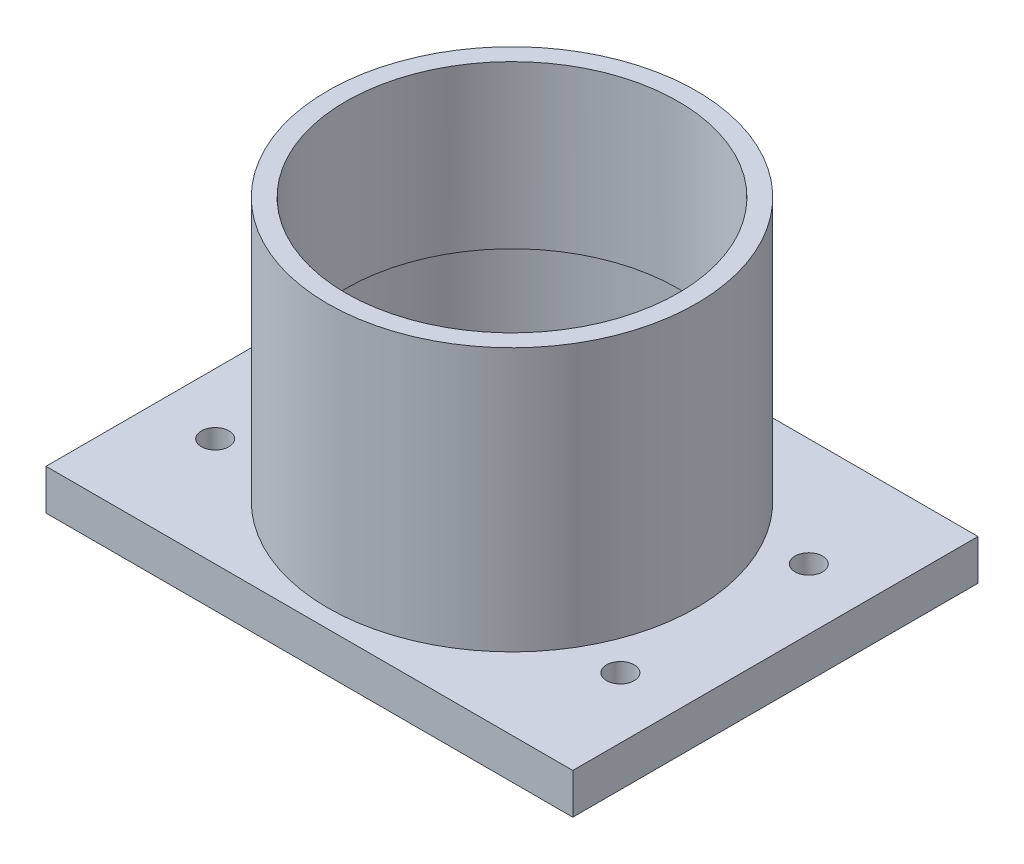
ISO-10303-21;
HEADER;
FILE_DESCRIPTION(('STEP AP214'),'2;1');
FILE_NAME('part.step','',(''),(''),'','','');
FILE_SCHEMA(('AUTOMOTIVE_DESIGN { 1 0 10303 214 1 1 1 1 }'));
ENDSEC;
DATA;
#1=APPLICATION_CONTEXT('core data for automotive mechanical design processes');
#2=APPLICATION_PROTOCOL_DEFINITION('international standard','automotive_design',2000,#1);
#3=PRODUCT_CONTEXT('',#1,'mechanical');
#4=PRODUCT('Part','Part','',(#3));
#5=PRODUCT_RELATED_PRODUCT_CATEGORY('part','',(#4));
#6=PRODUCT_DEFINITION_FORMATION('','',#4);
#7=PRODUCT_DEFINITION_CONTEXT('part definition',#1,'design');
#8=PRODUCT_DEFINITION('design','',#6,#7);
#9=PRODUCT_DEFINITION_SHAPE('','',#8);
#10=(LENGTH_UNIT() NAMED_UNIT(*) SI_UNIT(.MILLI.,.METRE.));
#11=(NAMED_UNIT(*) PLANE_ANGLE_UNIT() SI_UNIT($,.RADIAN.));
#12=(NAMED_UNIT(*) SI_UNIT($,.STERADIAN.) SOLID_ANGLE_UNIT());
#13=UNCERTAINTY_MEASURE_WITH_UNIT(LENGTH_MEASURE(1.E-05),#10,'distance_accuracy_value','');
#14=(GEOMETRIC_REPRESENTATION_CONTEXT(3) GLOBAL_UNCERTAINTY_ASSIGNED_CONTEXT((#13)) GLOBAL_UNIT_ASSIGNED_CONTEXT((#10,
#11,#12)) REPRESENTATION_CONTEXT('',''));
#15=CARTESIAN_POINT('',(0.,0.,0.));
#16=DIRECTION('',(0.,0.,1.));
#17=DIRECTION('',(1.,0.,0.));
#18=AXIS2_PLACEMENT_3D('',#15,#16,#17);
#19=CARTESIAN_POINT('',(0.,0.,0.));
#20=DIRECTION('',(0.,1.,0.));
#21=DIRECTION('',(0.,0.,1.));
#22=AXIS2_PLACEMENT_3D('',#19,#20,#21);
#23=CYLINDRICAL_SURFACE('',#22,41.);
#24=CARTESIAN_POINT('',(0.,75.,0.));
#25=DIRECTION('',(0.,1.,0.));
#26=DIRECTION('',(0.,0.,1.));
#27=AXIS2_PLACEMENT_3D('',#24,#25,#26);
#28=CIRCLE('',#27,41.);
#29=CARTESIAN_POINT('',(0.,75.,41.));
#30=VERTEX_POINT('',#29);
#31=EDGE_CURVE('E138',#30,#30,#28,.T.);
#32=ORIENTED_EDGE('',*,*,#31,.T.);
#33=EDGE_LOOP('',(#32));
#34=FACE_BOUND('',#33,.T.);
#35=CARTESIAN_POINT('',(0.,35.,0.));
#36=DIRECTION('',(0.,-1.,0.));
#37=DIRECTION('',(0.,0.,-1.));
#38=AXIS2_PLACEMENT_3D('',#35,#36,#37);
#39=CIRCLE('',#38,41.);
#40=CARTESIAN_POINT('',(0.,35.,-41.));
#41=VERTEX_POINT('',#40);
#42=EDGE_CURVE('E134',#41,#41,#39,.F.);
#43=ORIENTED_EDGE('',*,*,#42,.F.);
#44=EDGE_LOOP('',(#43));
#45=FACE_BOUND('',#44,.T.);
#46=ADVANCED_FACE('F43',(#34,#45),#23,.F.);
#47=CARTESIAN_POINT('',(65.,10.,50.));
#48=DIRECTION('',(-1.,0.,0.));
#49=DIRECTION('',(0.,0.,1.));
#50=AXIS2_PLACEMENT_3D('',#47,#48,#49);
#51=PLANE('',#50);
#52=DIRECTION('',(0.,0.,-1.));
#53=VECTOR('',#52,1.);
#54=CARTESIAN_POINT('',(65.,0.,50.));
#55=LINE('',#54,#53);
#56=CARTESIAN_POINT('',(65.,0.,50.));
#57=VERTEX_POINT('',#56);
#58=CARTESIAN_POINT('',(65.,0.,-50.));
#59=VERTEX_POINT('',#58);
#60=EDGE_CURVE('E117',#57,#59,#55,.T.);
#61=ORIENTED_EDGE('',*,*,#60,.T.);
#62=DIRECTION('',(0.,-1.,0.));
#63=VECTOR('',#62,1.);
#64=CARTESIAN_POINT('',(65.,10.,-50.));
#65=LINE('',#64,#63);
#66=CARTESIAN_POINT('',(65.,10.,-50.));
#67=VERTEX_POINT('',#66);
#68=EDGE_CURVE('E54',#67,#59,#65,.T.);
#69=ORIENTED_EDGE('',*,*,#68,.F.);
#70=DIRECTION('',(0.,0.,-1.));
#71=VECTOR('',#70,1.);
#72=CARTESIAN_POINT('',(65.,10.,50.));
#73=LINE('',#72,#71);
#74=CARTESIAN_POINT('',(65.,10.,50.));
#75=VERTEX_POINT('',#74);
#76=EDGE_CURVE('E99',#75,#67,#73,.T.);
#77=ORIENTED_EDGE('',*,*,#76,.F.);
#78=DIRECTION('',(0.,-1.,0.));
#79=VECTOR('',#78,1.);
#80=CARTESIAN_POINT('',(65.,10.,50.));
#81=LINE('',#80,#79);
#82=EDGE_CURVE('E113',#75,#57,#81,.T.);
#83=ORIENTED_EDGE('',*,*,#82,.T.);
#84=EDGE_LOOP('',(#61,#69,#77,#83));
#85=FACE_BOUND('',#84,.T.);
#86=ADVANCED_FACE('F45',(#85),#51,.F.);
#87=CARTESIAN_POINT('',(-65.,10.,-50.));
#88=DIRECTION('',(0.,0.,1.));
#89=DIRECTION('',(1.,0.,0.));
#90=AXIS2_PLACEMENT_3D('',#87,#88,#89);
#91=PLANE('',#90);
#92=DIRECTION('',(-1.,0.,0.));
#93=VECTOR('',#92,1.);
#94=CARTESIAN_POINT('',(-65.,0.,-50.));
#95=LINE('',#94,#93);
#96=CARTESIAN_POINT('',(-65.,0.,-50.));
#97=VERTEX_POINT('',#96);
#98=EDGE_CURVE('E105',#59,#97,#95,.T.);
#99=ORIENTED_EDGE('',*,*,#98,.T.);
#100=DIRECTION('',(0.,-1.,0.));
#101=VECTOR('',#100,1.);
#102=CARTESIAN_POINT('',(-65.,10.,-50.));
#103=LINE('',#102,#101);
#104=CARTESIAN_POINT('',(-65.,10.,-50.));
#105=VERTEX_POINT('',#104);
#106=EDGE_CURVE('E103',#105,#97,#103,.T.);
#107=ORIENTED_EDGE('',*,*,#106,.F.);
#108=DIRECTION('',(-1.,0.,0.));
#109=VECTOR('',#108,1.);
#110=CARTESIAN_POINT('',(-65.,10.,-50.));
#111=LINE('',#110,#109);
#112=EDGE_CURVE('E94',#67,#105,#111,.T.);
#113=ORIENTED_EDGE('',*,*,#112,.F.);
#114=ORIENTED_EDGE('',*,*,#68,.T.);
#115=EDGE_LOOP('',(#99,#107,#113,#114));
#116=FACE_BOUND('',#115,.T.);
#117=ADVANCED_FACE('F104',(#116),#91,.F.);
#118=CARTESIAN_POINT('',(-65.,10.,50.));
#119=DIRECTION('',(1.,0.,0.));
#120=DIRECTION('',(0.,0.,-1.));
#121=AXIS2_PLACEMENT_3D('',#118,#119,#120);
#122=PLANE('',#121);
#123=DIRECTION('',(0.,0.,1.));
#124=VECTOR('',#123,1.);
#125=CARTESIAN_POINT('',(-65.,0.,50.));
#126=LINE('',#125,#124);
#127=CARTESIAN_POINT('',(-65.,0.,50.));
#128=VERTEX_POINT('',#127);
#129=EDGE_CURVE('E80',#97,#128,#126,.T.);
#130=ORIENTED_EDGE('',*,*,#129,.T.);
#131=DIRECTION('',(0.,-1.,0.));
#132=VECTOR('',#131,1.);
#133=CARTESIAN_POINT('',(-65.,10.,50.));
#134=LINE('',#133,#132);
#135=CARTESIAN_POINT('',(-65.,10.,50.));
#136=VERTEX_POINT('',#135);
#137=EDGE_CURVE('E107',#136,#128,#134,.T.);
#138=ORIENTED_EDGE('',*,*,#137,.F.);
#139=DIRECTION('',(0.,0.,1.));
#140=VECTOR('',#139,1.);
#141=CARTESIAN_POINT('',(-65.,10.,50.));
#142=LINE('',#141,#140);
#143=EDGE_CURVE('E97',#105,#136,#142,.T.);
#144=ORIENTED_EDGE('',*,*,#143,.F.);
#145=ORIENTED_EDGE('',*,*,#106,.T.);
#146=EDGE_LOOP('',(#130,#138,#144,#145));
#147=FACE_BOUND('',#146,.T.);
#148=ADVANCED_FACE('F109',(#147),#122,.F.);
#149=CARTESIAN_POINT('',(-65.,10.,50.));
#150=DIRECTION('',(0.,0.,-1.));
#151=DIRECTION('',(-1.,0.,0.));
#152=AXIS2_PLACEMENT_3D('',#149,#150,#151);
#153=PLANE('',#152);
#154=DIRECTION('',(1.,0.,0.));
#155=VECTOR('',#154,1.);
#156=CARTESIAN_POINT('',(-65.,0.,50.));
#157=LINE('',#156,#155);
#158=EDGE_CURVE('E86',#128,#57,#157,.T.);
#159=ORIENTED_EDGE('',*,*,#158,.T.);
#160=ORIENTED_EDGE('',*,*,#82,.F.);
#161=DIRECTION('',(1.,0.,0.));
#162=VECTOR('',#161,1.);
#163=CARTESIAN_POINT('',(-65.,10.,50.));
#164=LINE('',#163,#162);
#165=EDGE_CURVE('E63',#136,#75,#164,.T.);
#166=ORIENTED_EDGE('',*,*,#165,.F.);
#167=ORIENTED_EDGE('',*,*,#137,.T.);
#168=EDGE_LOOP('',(#159,#160,#166,#167));
#169=FACE_BOUND('',#168,.T.);
#170=ADVANCED_FACE('F196',(#169),#153,.F.);
#171=CARTESIAN_POINT('',(0.,10.,0.));
#172=DIRECTION('',(0.,-1.,0.));
#173=DIRECTION('',(0.,0.,-1.));
#174=AXIS2_PLACEMENT_3D('',#171,#172,#173);
#175=PLANE('',#174);
#176=CARTESIAN_POINT('',(-50.,10.,-23.25));
#177=DIRECTION('',(0.,1.,0.));
#178=DIRECTION('',(0.,0.,1.));
#179=AXIS2_PLACEMENT_3D('',#176,#177,#178);
#180=CIRCLE('',#179,3.39999999999999);
#181=CARTESIAN_POINT('',(-50.,10.,-19.85));
#182=VERTEX_POINT('',#181);
#183=EDGE_CURVE('E166',#182,#182,#180,.T.);
#184=ORIENTED_EDGE('',*,*,#183,.F.);
#185=EDGE_LOOP('',(#184));
#186=FACE_BOUND('',#185,.T.);
#187=CARTESIAN_POINT('',(-50.,10.,23.25));
#188=DIRECTION('',(0.,1.,0.));
#189=DIRECTION('',(0.,0.,1.));
#190=AXIS2_PLACEMENT_3D('',#187,#188,#189);
#191=CIRCLE('',#190,3.39999999999999);
#192=CARTESIAN_POINT('',(-50.,10.,26.65));
#193=VERTEX_POINT('',#192);
#194=EDGE_CURVE('E153',#193,#193,#191,.T.);
#195=ORIENTED_EDGE('',*,*,#194,.F.);
#196=EDGE_LOOP('',(#195));
#197=FACE_BOUND('',#196,.T.);
#198=CARTESIAN_POINT('',(50.,10.,23.25));
#199=DIRECTION('',(0.,1.,0.));
#200=DIRECTION('',(0.,0.,1.));
#201=AXIS2_PLACEMENT_3D('',#198,#199,#200);
#202=CIRCLE('',#201,3.39999999999999);
#203=CARTESIAN_POINT('',(50.,10.,26.65));
#204=VERTEX_POINT('',#203);
#205=EDGE_CURVE('E149',#204,#204,#202,.T.);
#206=ORIENTED_EDGE('',*,*,#205,.F.);
#207=EDGE_LOOP('',(#206));
#208=FACE_BOUND('',#207,.T.);
#209=CARTESIAN_POINT('',(50.,10.,-23.25));
#210=DIRECTION('',(0.,1.,0.));
#211=DIRECTION('',(0.,0.,1.));
#212=AXIS2_PLACEMENT_3D('',#209,#210,#211);
#213=CIRCLE('',#212,3.39999999999999);
#214=CARTESIAN_POINT('',(50.,10.,-19.85));
#215=VERTEX_POINT('',#214);
#216=EDGE_CURVE('E145',#215,#215,#213,.T.);
#217=ORIENTED_EDGE('',*,*,#216,.F.);
#218=EDGE_LOOP('',(#217));
#219=FACE_BOUND('',#218,.T.);
#220=CARTESIAN_POINT('',(0.,10.,0.));
#221=DIRECTION('',(0.,1.,0.));
#222=DIRECTION('',(0.,0.,1.));
#223=AXIS2_PLACEMENT_3D('',#220,#221,#222);
#224=CIRCLE('',#223,45.5);
#225=CARTESIAN_POINT('',(0.,10.,45.5));
#226=VERTEX_POINT('',#225);
#227=EDGE_CURVE('E11',#226,#226,#224,.T.);
#228=ORIENTED_EDGE('',*,*,#227,.F.);
#229=EDGE_LOOP('',(#228));
#230=FACE_BOUND('',#229,.T.);
#231=ORIENTED_EDGE('',*,*,#76,.T.);
#232=ORIENTED_EDGE('',*,*,#112,.T.);
#233=ORIENTED_EDGE('',*,*,#143,.T.);
#234=ORIENTED_EDGE('',*,*,#165,.T.);
#235=EDGE_LOOP('',(#231,#232,#233,#234));
#236=FACE_BOUND('',#235,.T.);
#237=ADVANCED_FACE('F95',(#186,#197,#208,#219,#230,#236),#175,.F.);
#238=CARTESIAN_POINT('',(0.,0.,0.));
#239=DIRECTION('',(0.,-1.,0.));
#240=DIRECTION('',(0.,0.,-1.));
#241=AXIS2_PLACEMENT_3D('',#238,#239,#240);
#242=PLANE('',#241);
#243=CARTESIAN_POINT('',(-50.,0.,-23.25));
#244=DIRECTION('',(0.,-1.,0.));
#245=DIRECTION('',(0.,0.,-1.));
#246=AXIS2_PLACEMENT_3D('',#243,#244,#245);
#247=CIRCLE('',#246,3.39999999999999);
#248=CARTESIAN_POINT('',(-50.,0.,-26.65));
#249=VERTEX_POINT('',#248);
#250=EDGE_CURVE('E47',#249,#249,#247,.T.);
#251=ORIENTED_EDGE('',*,*,#250,.F.);
#252=EDGE_LOOP('',(#251));
#253=FACE_BOUND('',#252,.T.);
#254=CARTESIAN_POINT('',(-50.,0.,23.25));
#255=DIRECTION('',(0.,-1.,0.));
#256=DIRECTION('',(0.,0.,-1.));
#257=AXIS2_PLACEMENT_3D('',#254,#255,#256);
#258=CIRCLE('',#257,3.39999999999999);
#259=CARTESIAN_POINT('',(-50.,0.,19.85));
#260=VERTEX_POINT('',#259);
#261=EDGE_CURVE('E150',#260,#260,#258,.T.);
#262=ORIENTED_EDGE('',*,*,#261,.F.);
#263=EDGE_LOOP('',(#262));
#264=FACE_BOUND('',#263,.T.);
#265=CARTESIAN_POINT('',(50.,0.,23.25));
#266=DIRECTION('',(0.,-1.,0.));
#267=DIRECTION('',(0.,0.,-1.));
#268=AXIS2_PLACEMENT_3D('',#265,#266,#267);
#269=CIRCLE('',#268,3.39999999999999);
#270=CARTESIAN_POINT('',(50.,0.,19.85));
#271=VERTEX_POINT('',#270);
#272=EDGE_CURVE('E146',#271,#271,#269,.T.);
#273=ORIENTED_EDGE('',*,*,#272,.F.);
#274=EDGE_LOOP('',(#273));
#275=FACE_BOUND('',#274,.T.);
#276=CARTESIAN_POINT('',(50.,0.,-23.25));
#277=DIRECTION('',(0.,-1.,0.));
#278=DIRECTION('',(0.,0.,-1.));
#279=AXIS2_PLACEMENT_3D('',#276,#277,#278);
#280=CIRCLE('',#279,3.39999999999999);
#281=CARTESIAN_POINT('',(50.,0.,-26.65));
#282=VERTEX_POINT('',#281);
#283=EDGE_CURVE('E140',#282,#282,#280,.T.);
#284=ORIENTED_EDGE('',*,*,#283,.F.);
#285=EDGE_LOOP('',(#284));
#286=FACE_BOUND('',#285,.T.);
#287=CARTESIAN_POINT('',(0.,0.,0.));
#288=DIRECTION('',(0.,-1.,0.));
#289=DIRECTION('',(0.,0.,-1.));
#290=AXIS2_PLACEMENT_3D('',#287,#288,#289);
#291=CIRCLE('',#290,42.5);
#292=CARTESIAN_POINT('',(0.,0.,-42.5));
#293=VERTEX_POINT('',#292);
#294=EDGE_CURVE('E144',#293,#293,#291,.T.);
#295=ORIENTED_EDGE('',*,*,#294,.F.);
#296=EDGE_LOOP('',(#295));
#297=FACE_BOUND('',#296,.T.);
#298=ORIENTED_EDGE('',*,*,#60,.F.);
#299=ORIENTED_EDGE('',*,*,#158,.F.);
#300=ORIENTED_EDGE('',*,*,#129,.F.);
#301=ORIENTED_EDGE('',*,*,#98,.F.);
#302=EDGE_LOOP('',(#298,#299,#300,#301));
#303=FACE_BOUND('',#302,.T.);
#304=ADVANCED_FACE('F191',(#253,#264,#275,#286,#297,#303),#242,.T.);
#305=CARTESIAN_POINT('',(0.,75.,0.));
#306=DIRECTION('',(0.,-1.,0.));
#307=DIRECTION('',(0.,0.,-1.));
#308=AXIS2_PLACEMENT_3D('',#305,#306,#307);
#309=CYLINDRICAL_SURFACE('',#308,45.5);
#310=CARTESIAN_POINT('',(0.,75.,0.));
#311=DIRECTION('',(0.,1.,0.));
#312=DIRECTION('',(0.,0.,1.));
#313=AXIS2_PLACEMENT_3D('',#310,#311,#312);
#314=CIRCLE('',#313,45.5);
#315=CARTESIAN_POINT('',(0.,75.,45.5));
#316=VERTEX_POINT('',#315);
#317=EDGE_CURVE('E121',#316,#316,#314,.T.);
#318=ORIENTED_EDGE('',*,*,#317,.F.);
#319=EDGE_LOOP('',(#318));
#320=FACE_BOUND('',#319,.T.);
#321=ORIENTED_EDGE('',*,*,#227,.T.);
#322=EDGE_LOOP('',(#321));
#323=FACE_BOUND('',#322,.T.);
#324=ADVANCED_FACE('F188',(#320,#323),#309,.T.);
#325=CARTESIAN_POINT('',(0.,75.,0.));
#326=DIRECTION('',(0.,1.,0.));
#327=DIRECTION('',(0.,0.,1.));
#328=AXIS2_PLACEMENT_3D('',#325,#326,#327);
#329=PLANE('',#328);
#330=ORIENTED_EDGE('',*,*,#31,.F.);
#331=EDGE_LOOP('',(#330));
#332=FACE_BOUND('',#331,.T.);
#333=ORIENTED_EDGE('',*,*,#317,.T.);
#334=EDGE_LOOP('',(#333));
#335=FACE_BOUND('',#334,.T.);
#336=ADVANCED_FACE('F186',(#332,#335),#329,.T.);
#337=CARTESIAN_POINT('',(0.,35.,0.));
#338=DIRECTION('',(0.,-1.,0.));
#339=DIRECTION('',(0.,0.,-1.));
#340=AXIS2_PLACEMENT_3D('',#337,#338,#339);
#341=PLANE('',#340);
#342=CARTESIAN_POINT('',(0.,35.,0.));
#343=DIRECTION('',(0.,-1.,0.));
#344=DIRECTION('',(0.,0.,-1.));
#345=AXIS2_PLACEMENT_3D('',#342,#343,#344);
#346=CIRCLE('',#345,42.5);
#347=CARTESIAN_POINT('',(0.,35.,-42.5));
#348=VERTEX_POINT('',#347);
#349=EDGE_CURVE('E139',#348,#348,#346,.T.);
#350=ORIENTED_EDGE('',*,*,#349,.T.);
#351=EDGE_LOOP('',(#350));
#352=FACE_BOUND('',#351,.T.);
#353=ORIENTED_EDGE('',*,*,#42,.T.);
#354=EDGE_LOOP('',(#353));
#355=FACE_BOUND('',#354,.T.);
#356=ADVANCED_FACE('F221',(#352,#355),#341,.T.);
#357=CARTESIAN_POINT('',(0.,35.,0.));
#358=DIRECTION('',(0.,-1.,0.));
#359=DIRECTION('',(0.,0.,-1.));
#360=AXIS2_PLACEMENT_3D('',#357,#358,#359);
#361=CYLINDRICAL_SURFACE('',#360,42.5);
#362=ORIENTED_EDGE('',*,*,#349,.F.);
#363=EDGE_LOOP('',(#362));
#364=FACE_BOUND('',#363,.T.);
#365=ORIENTED_EDGE('',*,*,#294,.T.);
#366=EDGE_LOOP('',(#365));
#367=FACE_BOUND('',#366,.T.);
#368=ADVANCED_FACE('F218',(#364,#367),#361,.F.);
#369=CARTESIAN_POINT('',(50.,10.,-23.25));
#370=DIRECTION('',(0.,1.,0.));
#371=DIRECTION('',(0.,0.,1.));
#372=AXIS2_PLACEMENT_3D('',#369,#370,#371);
#373=CYLINDRICAL_SURFACE('',#372,3.39999999999999);
#374=ORIENTED_EDGE('',*,*,#283,.T.);
#375=EDGE_LOOP('',(#374));
#376=FACE_BOUND('',#375,.T.);
#377=ORIENTED_EDGE('',*,*,#216,.T.);
#378=EDGE_LOOP('',(#377));
#379=FACE_BOUND('',#378,.T.);
#380=ADVANCED_FACE('F231',(#376,#379),#373,.F.);
#381=CARTESIAN_POINT('',(50.,10.,23.25));
#382=DIRECTION('',(0.,1.,0.));
#383=DIRECTION('',(0.,0.,1.));
#384=AXIS2_PLACEMENT_3D('',#381,#382,#383);
#385=CYLINDRICAL_SURFACE('',#384,3.39999999999999);
#386=ORIENTED_EDGE('',*,*,#272,.T.);
#387=EDGE_LOOP('',(#386));
#388=FACE_BOUND('',#387,.T.);
#389=ORIENTED_EDGE('',*,*,#205,.T.);
#390=EDGE_LOOP('',(#389));
#391=FACE_BOUND('',#390,.T.);
#392=ADVANCED_FACE('F237',(#388,#391),#385,.F.);
#393=CARTESIAN_POINT('',(-50.,10.,23.25));
#394=DIRECTION('',(0.,1.,0.));
#395=DIRECTION('',(0.,0.,1.));
#396=AXIS2_PLACEMENT_3D('',#393,#394,#395);
#397=CYLINDRICAL_SURFACE('',#396,3.39999999999999);
#398=ORIENTED_EDGE('',*,*,#261,.T.);
#399=EDGE_LOOP('',(#398));
#400=FACE_BOUND('',#399,.T.);
#401=ORIENTED_EDGE('',*,*,#194,.T.);
#402=EDGE_LOOP('',(#401));
#403=FACE_BOUND('',#402,.T.);
#404=ADVANCED_FACE('F241',(#400,#403),#397,.F.);
#405=CARTESIAN_POINT('',(-50.,10.,-23.25));
#406=DIRECTION('',(0.,1.,0.));
#407=DIRECTION('',(0.,0.,1.));
#408=AXIS2_PLACEMENT_3D('',#405,#406,#407);
#409=CYLINDRICAL_SURFACE('',#408,3.39999999999999);
#410=ORIENTED_EDGE('',*,*,#250,.T.);
#411=EDGE_LOOP('',(#410));
#412=FACE_BOUND('',#411,.T.);
#413=ORIENTED_EDGE('',*,*,#183,.T.);
#414=EDGE_LOOP('',(#413));
#415=FACE_BOUND('',#414,.T.);
#416=ADVANCED_FACE('F245',(#412,#415),#409,.F.);
#417=CLOSED_SHELL('',(#46,#86,#117,#148,#170,#237,#304,#324,#336,#356,#368,#380,#392,#404,#416));
#418=MANIFOLD_SOLID_BREP('B2',#417);
#419=ADVANCED_BREP_SHAPE_REPRESENTATION('',(#18,#418),#14);
#420=SHAPE_DEFINITION_REPRESENTATION(#9,#419);
ENDSEC;
END-ISO-10303-21;
